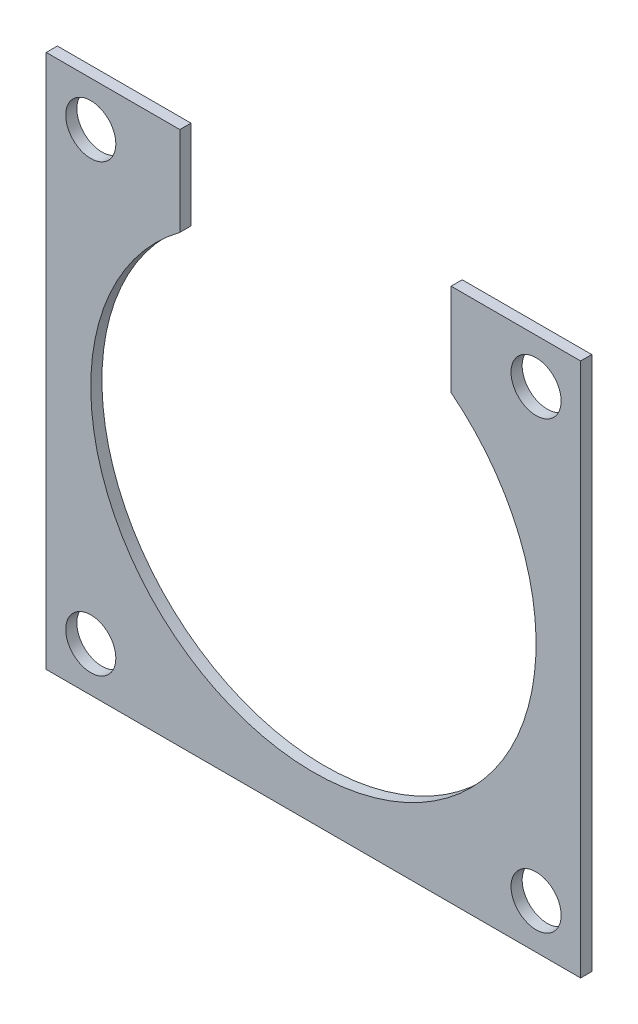
ISO-10303-21;
HEADER;
FILE_DESCRIPTION(('STEP AP214'),'2;1');
FILE_NAME('part.step','',(''),(''),'','','');
FILE_SCHEMA(('AUTOMOTIVE_DESIGN { 1 0 10303 214 1 1 1 1 }'));
ENDSEC;
DATA;
#1=APPLICATION_CONTEXT('core data for automotive mechanical design processes');
#2=APPLICATION_PROTOCOL_DEFINITION('international standard','automotive_design',2000,#1);
#3=PRODUCT_CONTEXT('',#1,'mechanical');
#4=PRODUCT('Part','Part','',(#3));
#5=PRODUCT_RELATED_PRODUCT_CATEGORY('part','',(#4));
#6=PRODUCT_DEFINITION_FORMATION('','',#4);
#7=PRODUCT_DEFINITION_CONTEXT('part definition',#1,'design');
#8=PRODUCT_DEFINITION('design','',#6,#7);
#9=PRODUCT_DEFINITION_SHAPE('','',#8);
#10=(LENGTH_UNIT() NAMED_UNIT(*) SI_UNIT(.MILLI.,.METRE.));
#11=(NAMED_UNIT(*) PLANE_ANGLE_UNIT() SI_UNIT($,.RADIAN.));
#12=(NAMED_UNIT(*) SI_UNIT($,.STERADIAN.) SOLID_ANGLE_UNIT());
#13=UNCERTAINTY_MEASURE_WITH_UNIT(LENGTH_MEASURE(1.E-05),#10,'distance_accuracy_value','');
#14=(GEOMETRIC_REPRESENTATION_CONTEXT(3) GLOBAL_UNCERTAINTY_ASSIGNED_CONTEXT((#13)) GLOBAL_UNIT_ASSIGNED_CONTEXT((#10,
#11,#12)) REPRESENTATION_CONTEXT('',''));
#15=CARTESIAN_POINT('',(0.,0.,0.));
#16=DIRECTION('',(0.,0.,1.));
#17=DIRECTION('',(1.,0.,0.));
#18=AXIS2_PLACEMENT_3D('',#15,#16,#17);
#19=CARTESIAN_POINT('',(0.,0.,1.5875));
#20=DIRECTION('',(0.,0.,1.));
#21=DIRECTION('',(1.,0.,0.));
#22=AXIS2_PLACEMENT_3D('',#19,#20,#21);
#23=PLANE('',#22);
#24=CARTESIAN_POINT('',(31.75,31.7499999999996,1.5875));
#25=DIRECTION('',(0.,0.,-1.));
#26=DIRECTION('',(-1.,0.,0.));
#27=AXIS2_PLACEMENT_3D('',#24,#25,#26);
#28=CIRCLE('',#27,3.57245345743552);
#29=CARTESIAN_POINT('',(28.1775465425645,31.7499999999996,1.5875));
#30=VERTEX_POINT('',#29);
#31=EDGE_CURVE('E158',#30,#30,#28,.T.);
#32=ORIENTED_EDGE('',*,*,#31,.T.);
#33=EDGE_LOOP('',(#32));
#34=FACE_BOUND('',#33,.T.);
#35=DIRECTION('',(0.,-1.,0.));
#36=VECTOR('',#35,1.);
#37=CARTESIAN_POINT('',(-19.05,64.2894887834036,1.5875));
#38=LINE('',#37,#36);
#39=CARTESIAN_POINT('',(-19.05,38.1,1.5875));
#40=VERTEX_POINT('',#39);
#41=CARTESIAN_POINT('',(-19.05,25.4,1.5875));
#42=VERTEX_POINT('',#41);
#43=EDGE_CURVE('E56',#40,#42,#38,.T.);
#44=ORIENTED_EDGE('',*,*,#43,.F.);
#45=DIRECTION('',(-1.,0.,0.));
#46=VECTOR('',#45,1.);
#47=CARTESIAN_POINT('',(-38.1,38.1,1.5875));
#48=LINE('',#47,#46);
#49=CARTESIAN_POINT('',(-38.1,38.1,1.5875));
#50=VERTEX_POINT('',#49);
#51=EDGE_CURVE('E110',#40,#50,#48,.T.);
#52=ORIENTED_EDGE('',*,*,#51,.T.);
#53=DIRECTION('',(0.,-1.,0.));
#54=VECTOR('',#53,1.);
#55=CARTESIAN_POINT('',(-38.1,38.1,1.5875));
#56=LINE('',#55,#54);
#57=CARTESIAN_POINT('',(-38.1,-38.1,1.5875));
#58=VERTEX_POINT('',#57);
#59=EDGE_CURVE('E141',#50,#58,#56,.T.);
#60=ORIENTED_EDGE('',*,*,#59,.T.);
#61=DIRECTION('',(1.,0.,0.));
#62=VECTOR('',#61,1.);
#63=CARTESIAN_POINT('',(-38.1,-38.1,1.5875));
#64=LINE('',#63,#62);
#65=CARTESIAN_POINT('',(38.1,-38.1,1.5875));
#66=VERTEX_POINT('',#65);
#67=EDGE_CURVE('E126',#58,#66,#64,.T.);
#68=ORIENTED_EDGE('',*,*,#67,.T.);
#69=DIRECTION('',(0.,1.,0.));
#70=VECTOR('',#69,1.);
#71=CARTESIAN_POINT('',(38.1,38.1,1.5875));
#72=LINE('',#71,#70);
#73=CARTESIAN_POINT('',(38.1,38.1,1.5875));
#74=VERTEX_POINT('',#73);
#75=EDGE_CURVE('E123',#66,#74,#72,.T.);
#76=ORIENTED_EDGE('',*,*,#75,.T.);
#77=CARTESIAN_POINT('',(19.6289220358491,38.1,1.5875));
#78=VERTEX_POINT('',#77);
#79=EDGE_CURVE('E122',#74,#78,#48,.T.);
#80=ORIENTED_EDGE('',*,*,#79,.T.);
#81=DIRECTION('',(0.,1.,0.));
#82=VECTOR('',#81,1.);
#83=CARTESIAN_POINT('',(19.6289220358491,64.2894887834036,1.5875));
#84=LINE('',#83,#82);
#85=CARTESIAN_POINT('',(19.6289220358491,24.9553184654205,1.5875));
#86=VERTEX_POINT('',#85);
#87=EDGE_CURVE('E115',#86,#78,#84,.T.);
#88=ORIENTED_EDGE('',*,*,#87,.F.);
#89=CARTESIAN_POINT('',(0.,0.,1.5875));
#90=DIRECTION('',(0.,0.,1.));
#91=DIRECTION('',(1.,0.,0.));
#92=AXIS2_PLACEMENT_3D('',#89,#90,#91);
#93=CIRCLE('',#92,31.75);
#94=EDGE_CURVE('E114',#42,#86,#93,.T.);
#95=ORIENTED_EDGE('',*,*,#94,.F.);
#96=EDGE_LOOP('',(#44,#52,#60,#68,#76,#80,#88,#95));
#97=FACE_BOUND('',#96,.T.);
#98=CARTESIAN_POINT('',(-31.75,31.7499999999996,1.5875));
#99=DIRECTION('',(0.,0.,1.));
#100=DIRECTION('',(1.,0.,0.));
#101=AXIS2_PLACEMENT_3D('',#98,#99,#100);
#102=CIRCLE('',#101,3.57245345743552);
#103=CARTESIAN_POINT('',(-28.1775465425645,31.7499999999996,1.5875));
#104=VERTEX_POINT('',#103);
#105=EDGE_CURVE('E103',#104,#104,#102,.T.);
#106=ORIENTED_EDGE('',*,*,#105,.F.);
#107=EDGE_LOOP('',(#106));
#108=FACE_BOUND('',#107,.T.);
#109=CARTESIAN_POINT('',(31.75,-31.7499999999996,1.5875));
#110=DIRECTION('',(0.,0.,1.));
#111=DIRECTION('',(-1.,0.,0.));
#112=AXIS2_PLACEMENT_3D('',#109,#110,#111);
#113=CIRCLE('',#112,3.57245345743552);
#114=CARTESIAN_POINT('',(28.1775465425645,-31.7499999999996,1.5875));
#115=VERTEX_POINT('',#114);
#116=EDGE_CURVE('E161',#115,#115,#113,.T.);
#117=ORIENTED_EDGE('',*,*,#116,.F.);
#118=EDGE_LOOP('',(#117));
#119=FACE_BOUND('',#118,.T.);
#120=CARTESIAN_POINT('',(-31.75,-31.7499999999996,1.5875));
#121=DIRECTION('',(0.,0.,-1.));
#122=DIRECTION('',(1.,0.,0.));
#123=AXIS2_PLACEMENT_3D('',#120,#121,#122);
#124=CIRCLE('',#123,3.57245345743552);
#125=CARTESIAN_POINT('',(-28.1775465425645,-31.7499999999996,1.5875));
#126=VERTEX_POINT('',#125);
#127=EDGE_CURVE('E171',#126,#126,#124,.T.);
#128=ORIENTED_EDGE('',*,*,#127,.T.);
#129=EDGE_LOOP('',(#128));
#130=FACE_BOUND('',#129,.T.);
#131=ADVANCED_FACE('F32',(#34,#97,#108,#119,#130),#23,.T.);
#132=CARTESIAN_POINT('',(0.,0.,0.));
#133=DIRECTION('',(0.,0.,1.));
#134=DIRECTION('',(1.,0.,0.));
#135=AXIS2_PLACEMENT_3D('',#132,#133,#134);
#136=PLANE('',#135);
#137=CARTESIAN_POINT('',(31.75,31.7499999999996,0.));
#138=DIRECTION('',(0.,0.,1.));
#139=DIRECTION('',(1.,0.,0.));
#140=AXIS2_PLACEMENT_3D('',#137,#138,#139);
#141=CIRCLE('',#140,3.57245345743552);
#142=CARTESIAN_POINT('',(35.3224534574355,31.7499999999996,0.));
#143=VERTEX_POINT('',#142);
#144=EDGE_CURVE('E116',#143,#143,#141,.F.);
#145=ORIENTED_EDGE('',*,*,#144,.F.);
#146=EDGE_LOOP('',(#145));
#147=FACE_BOUND('',#146,.T.);
#148=CARTESIAN_POINT('',(-31.75,31.7499999999996,0.));
#149=DIRECTION('',(0.,0.,1.));
#150=DIRECTION('',(1.,0.,0.));
#151=AXIS2_PLACEMENT_3D('',#148,#149,#150);
#152=CIRCLE('',#151,3.57245345743552);
#153=CARTESIAN_POINT('',(-28.1775465425645,31.7499999999996,0.));
#154=VERTEX_POINT('',#153);
#155=EDGE_CURVE('E152',#154,#154,#152,.T.);
#156=ORIENTED_EDGE('',*,*,#155,.T.);
#157=EDGE_LOOP('',(#156));
#158=FACE_BOUND('',#157,.T.);
#159=DIRECTION('',(-1.,0.,0.));
#160=VECTOR('',#159,1.);
#161=CARTESIAN_POINT('',(-38.1,38.1,0.));
#162=LINE('',#161,#160);
#163=CARTESIAN_POINT('',(-19.05,38.1,0.));
#164=VERTEX_POINT('',#163);
#165=CARTESIAN_POINT('',(-38.1,38.1,0.));
#166=VERTEX_POINT('',#165);
#167=EDGE_CURVE('E137',#164,#166,#162,.T.);
#168=ORIENTED_EDGE('',*,*,#167,.F.);
#169=DIRECTION('',(0.,-1.,0.));
#170=VECTOR('',#169,1.);
#171=CARTESIAN_POINT('',(-19.05,64.2894887834036,0.));
#172=LINE('',#171,#170);
#173=CARTESIAN_POINT('',(-19.05,25.4,0.));
#174=VERTEX_POINT('',#173);
#175=EDGE_CURVE('E99',#164,#174,#172,.T.);
#176=ORIENTED_EDGE('',*,*,#175,.T.);
#177=CARTESIAN_POINT('',(0.,0.,0.));
#178=DIRECTION('',(0.,0.,1.));
#179=DIRECTION('',(1.,0.,0.));
#180=AXIS2_PLACEMENT_3D('',#177,#178,#179);
#181=CIRCLE('',#180,31.75);
#182=CARTESIAN_POINT('',(19.6289220358491,24.9553184654205,0.));
#183=VERTEX_POINT('',#182);
#184=EDGE_CURVE('E155',#174,#183,#181,.T.);
#185=ORIENTED_EDGE('',*,*,#184,.T.);
#186=DIRECTION('',(0.,1.,0.));
#187=VECTOR('',#186,1.);
#188=CARTESIAN_POINT('',(19.6289220358491,64.2894887834036,0.));
#189=LINE('',#188,#187);
#190=CARTESIAN_POINT('',(19.6289220358491,38.1,0.));
#191=VERTEX_POINT('',#190);
#192=EDGE_CURVE('E49',#183,#191,#189,.T.);
#193=ORIENTED_EDGE('',*,*,#192,.T.);
#194=CARTESIAN_POINT('',(38.1,38.1,0.));
#195=VERTEX_POINT('',#194);
#196=EDGE_CURVE('E138',#195,#191,#162,.T.);
#197=ORIENTED_EDGE('',*,*,#196,.F.);
#198=DIRECTION('',(0.,1.,0.));
#199=VECTOR('',#198,1.);
#200=CARTESIAN_POINT('',(38.1,38.1,0.));
#201=LINE('',#200,#199);
#202=CARTESIAN_POINT('',(38.1,-38.1,0.));
#203=VERTEX_POINT('',#202);
#204=EDGE_CURVE('E135',#203,#195,#201,.T.);
#205=ORIENTED_EDGE('',*,*,#204,.F.);
#206=DIRECTION('',(1.,0.,0.));
#207=VECTOR('',#206,1.);
#208=CARTESIAN_POINT('',(-38.1,-38.1,0.));
#209=LINE('',#208,#207);
#210=CARTESIAN_POINT('',(-38.1,-38.1,0.));
#211=VERTEX_POINT('',#210);
#212=EDGE_CURVE('E133',#211,#203,#209,.T.);
#213=ORIENTED_EDGE('',*,*,#212,.F.);
#214=DIRECTION('',(0.,-1.,0.));
#215=VECTOR('',#214,1.);
#216=CARTESIAN_POINT('',(-38.1,38.1,0.));
#217=LINE('',#216,#215);
#218=EDGE_CURVE('E130',#166,#211,#217,.T.);
#219=ORIENTED_EDGE('',*,*,#218,.F.);
#220=EDGE_LOOP('',(#168,#176,#185,#193,#197,#205,#213,#219));
#221=FACE_BOUND('',#220,.T.);
#222=CARTESIAN_POINT('',(31.75,-31.7499999999996,0.));
#223=DIRECTION('',(0.,0.,1.));
#224=DIRECTION('',(1.,0.,0.));
#225=AXIS2_PLACEMENT_3D('',#222,#223,#224);
#226=CIRCLE('',#225,3.57245345743552);
#227=CARTESIAN_POINT('',(35.3224534574355,-31.7499999999996,0.));
#228=VERTEX_POINT('',#227);
#229=EDGE_CURVE('E159',#228,#228,#226,.T.);
#230=ORIENTED_EDGE('',*,*,#229,.T.);
#231=EDGE_LOOP('',(#230));
#232=FACE_BOUND('',#231,.T.);
#233=CARTESIAN_POINT('',(-31.75,-31.7499999999996,0.));
#234=DIRECTION('',(0.,0.,1.));
#235=DIRECTION('',(1.,0.,0.));
#236=AXIS2_PLACEMENT_3D('',#233,#234,#235);
#237=CIRCLE('',#236,3.57245345743552);
#238=CARTESIAN_POINT('',(-28.1775465425645,-31.7499999999996,0.));
#239=VERTEX_POINT('',#238);
#240=EDGE_CURVE('E36',#239,#239,#237,.F.);
#241=ORIENTED_EDGE('',*,*,#240,.F.);
#242=EDGE_LOOP('',(#241));
#243=FACE_BOUND('',#242,.T.);
#244=ADVANCED_FACE('F201',(#147,#158,#221,#232,#243),#136,.F.);
#245=CARTESIAN_POINT('',(-38.1,38.1,1.5875));
#246=DIRECTION('',(0.,-1.,0.));
#247=DIRECTION('',(0.,0.,-1.));
#248=AXIS2_PLACEMENT_3D('',#245,#246,#247);
#249=PLANE('',#248);
#250=ORIENTED_EDGE('',*,*,#51,.F.);
#251=DIRECTION('',(0.,0.,-1.));
#252=VECTOR('',#251,1.);
#253=CARTESIAN_POINT('',(-19.05,38.1,1.5875));
#254=LINE('',#253,#252);
#255=EDGE_CURVE('E96',#40,#164,#254,.T.);
#256=ORIENTED_EDGE('',*,*,#255,.T.);
#257=ORIENTED_EDGE('',*,*,#167,.T.);
#258=DIRECTION('',(0.,0.,-1.));
#259=VECTOR('',#258,1.);
#260=CARTESIAN_POINT('',(-38.1,38.1,1.5875));
#261=LINE('',#260,#259);
#262=EDGE_CURVE('E120',#50,#166,#261,.T.);
#263=ORIENTED_EDGE('',*,*,#262,.F.);
#264=EDGE_LOOP('',(#250,#256,#257,#263));
#265=FACE_BOUND('',#264,.T.);
#266=ADVANCED_FACE('F118',(#265),#249,.F.);
#267=CARTESIAN_POINT('',(-38.1,38.1,1.5875));
#268=DIRECTION('',(1.,0.,0.));
#269=DIRECTION('',(0.,1.,0.));
#270=AXIS2_PLACEMENT_3D('',#267,#268,#269);
#271=PLANE('',#270);
#272=ORIENTED_EDGE('',*,*,#218,.T.);
#273=DIRECTION('',(0.,0.,-1.));
#274=VECTOR('',#273,1.);
#275=CARTESIAN_POINT('',(-38.1,-38.1,1.5875));
#276=LINE('',#275,#274);
#277=EDGE_CURVE('E149',#58,#211,#276,.T.);
#278=ORIENTED_EDGE('',*,*,#277,.F.);
#279=ORIENTED_EDGE('',*,*,#59,.F.);
#280=ORIENTED_EDGE('',*,*,#262,.T.);
#281=EDGE_LOOP('',(#272,#278,#279,#280));
#282=FACE_BOUND('',#281,.T.);
#283=ADVANCED_FACE('F34',(#282),#271,.F.);
#284=CARTESIAN_POINT('',(-38.1,-38.1,1.5875));
#285=DIRECTION('',(0.,1.,0.));
#286=DIRECTION('',(0.,0.,1.));
#287=AXIS2_PLACEMENT_3D('',#284,#285,#286);
#288=PLANE('',#287);
#289=ORIENTED_EDGE('',*,*,#212,.T.);
#290=DIRECTION('',(0.,0.,-1.));
#291=VECTOR('',#290,1.);
#292=CARTESIAN_POINT('',(38.1,-38.1,1.5875));
#293=LINE('',#292,#291);
#294=EDGE_CURVE('E146',#66,#203,#293,.T.);
#295=ORIENTED_EDGE('',*,*,#294,.F.);
#296=ORIENTED_EDGE('',*,*,#67,.F.);
#297=ORIENTED_EDGE('',*,*,#277,.T.);
#298=EDGE_LOOP('',(#289,#295,#296,#297));
#299=FACE_BOUND('',#298,.T.);
#300=ADVANCED_FACE('F189',(#299),#288,.F.);
#301=CARTESIAN_POINT('',(38.1,38.1,1.5875));
#302=DIRECTION('',(-1.,0.,0.));
#303=DIRECTION('',(0.,-1.,0.));
#304=AXIS2_PLACEMENT_3D('',#301,#302,#303);
#305=PLANE('',#304);
#306=ORIENTED_EDGE('',*,*,#204,.T.);
#307=DIRECTION('',(0.,0.,-1.));
#308=VECTOR('',#307,1.);
#309=CARTESIAN_POINT('',(38.1,38.1,1.5875));
#310=LINE('',#309,#308);
#311=EDGE_CURVE('E143',#74,#195,#310,.T.);
#312=ORIENTED_EDGE('',*,*,#311,.F.);
#313=ORIENTED_EDGE('',*,*,#75,.F.);
#314=ORIENTED_EDGE('',*,*,#294,.T.);
#315=EDGE_LOOP('',(#306,#312,#313,#314));
#316=FACE_BOUND('',#315,.T.);
#317=ADVANCED_FACE('F192',(#316),#305,.F.);
#318=ORIENTED_EDGE('',*,*,#196,.T.);
#319=DIRECTION('',(0.,0.,1.));
#320=VECTOR('',#319,1.);
#321=CARTESIAN_POINT('',(19.6289220358491,38.1,1.5875));
#322=LINE('',#321,#320);
#323=EDGE_CURVE('E104',#191,#78,#322,.T.);
#324=ORIENTED_EDGE('',*,*,#323,.T.);
#325=ORIENTED_EDGE('',*,*,#79,.F.);
#326=ORIENTED_EDGE('',*,*,#311,.T.);
#327=EDGE_LOOP('',(#318,#324,#325,#326));
#328=FACE_BOUND('',#327,.T.);
#329=ADVANCED_FACE('F196',(#328),#249,.F.);
#330=CARTESIAN_POINT('',(0.,0.,1.5875));
#331=DIRECTION('',(0.,0.,-1.));
#332=DIRECTION('',(-1.,0.,0.));
#333=AXIS2_PLACEMENT_3D('',#330,#331,#332);
#334=CYLINDRICAL_SURFACE('',#333,31.75);
#335=DIRECTION('',(0.,0.,-1.));
#336=VECTOR('',#335,1.);
#337=CARTESIAN_POINT('',(-19.05,25.4,1.5875));
#338=LINE('',#337,#336);
#339=EDGE_CURVE('E11',#42,#174,#338,.T.);
#340=ORIENTED_EDGE('',*,*,#339,.F.);
#341=ORIENTED_EDGE('',*,*,#94,.T.);
#342=DIRECTION('',(0.,0.,-1.));
#343=VECTOR('',#342,1.);
#344=CARTESIAN_POINT('',(19.6289220358491,24.9553184654205,1.5875));
#345=LINE('',#344,#343);
#346=EDGE_CURVE('E41',#183,#86,#345,.F.);
#347=ORIENTED_EDGE('',*,*,#346,.F.);
#348=ORIENTED_EDGE('',*,*,#184,.F.);
#349=EDGE_LOOP('',(#340,#341,#347,#348));
#350=FACE_BOUND('',#349,.T.);
#351=ADVANCED_FACE('F198',(#350),#334,.F.);
#352=CARTESIAN_POINT('',(-31.75,31.7499999999996,-1.5875));
#353=DIRECTION('',(0.,0.,1.));
#354=DIRECTION('',(1.,0.,0.));
#355=AXIS2_PLACEMENT_3D('',#352,#353,#354);
#356=CYLINDRICAL_SURFACE('',#355,3.57245345743552);
#357=ORIENTED_EDGE('',*,*,#105,.T.);
#358=EDGE_LOOP('',(#357));
#359=FACE_BOUND('',#358,.T.);
#360=ORIENTED_EDGE('',*,*,#155,.F.);
#361=EDGE_LOOP('',(#360));
#362=FACE_BOUND('',#361,.T.);
#363=ADVANCED_FACE('F239',(#359,#362),#356,.F.);
#364=CARTESIAN_POINT('',(19.6289220358491,64.2894887834036,0.));
#365=DIRECTION('',(1.,0.,0.));
#366=DIRECTION('',(0.,1.,0.));
#367=AXIS2_PLACEMENT_3D('',#364,#365,#366);
#368=PLANE('',#367);
#369=ORIENTED_EDGE('',*,*,#192,.F.);
#370=ORIENTED_EDGE('',*,*,#346,.T.);
#371=ORIENTED_EDGE('',*,*,#87,.T.);
#372=ORIENTED_EDGE('',*,*,#323,.F.);
#373=EDGE_LOOP('',(#369,#370,#371,#372));
#374=FACE_BOUND('',#373,.T.);
#375=ADVANCED_FACE('F245',(#374),#368,.F.);
#376=CARTESIAN_POINT('',(-19.05,64.2894887834036,0.));
#377=DIRECTION('',(-1.,0.,0.));
#378=DIRECTION('',(0.,-1.,0.));
#379=AXIS2_PLACEMENT_3D('',#376,#377,#378);
#380=PLANE('',#379);
#381=ORIENTED_EDGE('',*,*,#43,.T.);
#382=ORIENTED_EDGE('',*,*,#339,.T.);
#383=ORIENTED_EDGE('',*,*,#175,.F.);
#384=ORIENTED_EDGE('',*,*,#255,.F.);
#385=EDGE_LOOP('',(#381,#382,#383,#384));
#386=FACE_BOUND('',#385,.T.);
#387=ADVANCED_FACE('F97',(#386),#380,.F.);
#388=CARTESIAN_POINT('',(31.75,31.7499999999996,-1.5875));
#389=DIRECTION('',(0.,0.,1.));
#390=DIRECTION('',(1.,0.,0.));
#391=AXIS2_PLACEMENT_3D('',#388,#389,#390);
#392=CYLINDRICAL_SURFACE('',#391,3.57245345743552);
#393=ORIENTED_EDGE('',*,*,#31,.F.);
#394=EDGE_LOOP('',(#393));
#395=FACE_BOUND('',#394,.T.);
#396=ORIENTED_EDGE('',*,*,#144,.T.);
#397=EDGE_LOOP('',(#396));
#398=FACE_BOUND('',#397,.T.);
#399=ADVANCED_FACE('F257',(#395,#398),#392,.F.);
#400=CARTESIAN_POINT('',(31.75,-31.7499999999996,-1.5875));
#401=DIRECTION('',(0.,0.,1.));
#402=DIRECTION('',(1.,0.,0.));
#403=AXIS2_PLACEMENT_3D('',#400,#401,#402);
#404=CYLINDRICAL_SURFACE('',#403,3.57245345743552);
#405=ORIENTED_EDGE('',*,*,#116,.T.);
#406=EDGE_LOOP('',(#405));
#407=FACE_BOUND('',#406,.T.);
#408=ORIENTED_EDGE('',*,*,#229,.F.);
#409=EDGE_LOOP('',(#408));
#410=FACE_BOUND('',#409,.T.);
#411=ADVANCED_FACE('F264',(#407,#410),#404,.F.);
#412=CARTESIAN_POINT('',(-31.75,-31.7499999999996,-1.5875));
#413=DIRECTION('',(0.,0.,1.));
#414=DIRECTION('',(1.,0.,0.));
#415=AXIS2_PLACEMENT_3D('',#412,#413,#414);
#416=CYLINDRICAL_SURFACE('',#415,3.57245345743552);
#417=ORIENTED_EDGE('',*,*,#127,.F.);
#418=EDGE_LOOP('',(#417));
#419=FACE_BOUND('',#418,.T.);
#420=ORIENTED_EDGE('',*,*,#240,.T.);
#421=EDGE_LOOP('',(#420));
#422=FACE_BOUND('',#421,.T.);
#423=ADVANCED_FACE('F272',(#419,#422),#416,.F.);
#424=CLOSED_SHELL('',(#131,#244,#266,#283,#300,#317,#329,#351,#363,#375,#387,#399,#411,#423));
#425=MANIFOLD_SOLID_BREP('B2',#424);
#426=ADVANCED_BREP_SHAPE_REPRESENTATION('',(#18,#425),#14);
#427=SHAPE_DEFINITION_REPRESENTATION(#9,#426);
ENDSEC;
END-ISO-10303-21;
